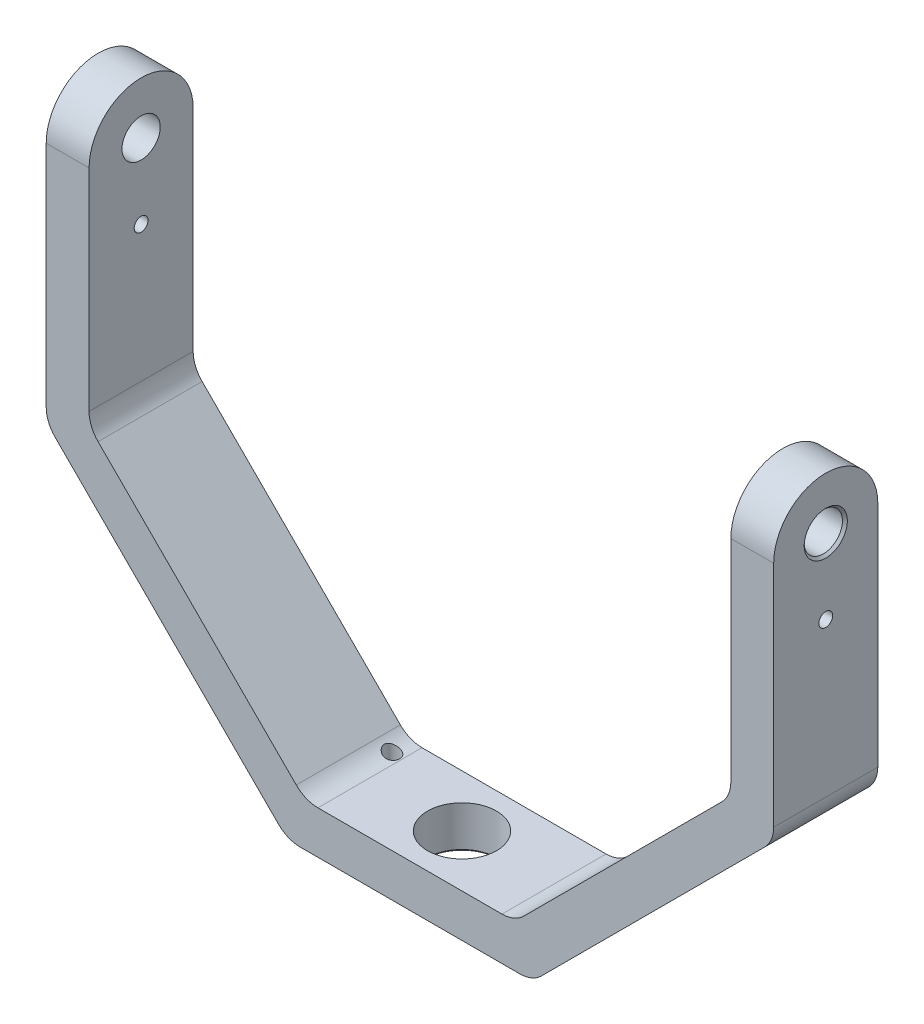
ISO-10303-21;
HEADER;
FILE_DESCRIPTION(('STEP AP214'),'2;1');
FILE_NAME('part.step','',(''),(''),'','','');
FILE_SCHEMA(('AUTOMOTIVE_DESIGN { 1 0 10303 214 1 1 1 1 }'));
ENDSEC;
DATA;
#1=APPLICATION_CONTEXT('core data for automotive mechanical design processes');
#2=APPLICATION_PROTOCOL_DEFINITION('international standard','automotive_design',2000,#1);
#3=PRODUCT_CONTEXT('',#1,'mechanical');
#4=PRODUCT('Part','Part','',(#3));
#5=PRODUCT_RELATED_PRODUCT_CATEGORY('part','',(#4));
#6=PRODUCT_DEFINITION_FORMATION('','',#4);
#7=PRODUCT_DEFINITION_CONTEXT('part definition',#1,'design');
#8=PRODUCT_DEFINITION('design','',#6,#7);
#9=PRODUCT_DEFINITION_SHAPE('','',#8);
#10=(LENGTH_UNIT() NAMED_UNIT(*) SI_UNIT(.MILLI.,.METRE.));
#11=(NAMED_UNIT(*) PLANE_ANGLE_UNIT() SI_UNIT($,.RADIAN.));
#12=(NAMED_UNIT(*) SI_UNIT($,.STERADIAN.) SOLID_ANGLE_UNIT());
#13=UNCERTAINTY_MEASURE_WITH_UNIT(LENGTH_MEASURE(1.E-05),#10,'distance_accuracy_value','');
#14=(GEOMETRIC_REPRESENTATION_CONTEXT(3) GLOBAL_UNCERTAINTY_ASSIGNED_CONTEXT((#13)) GLOBAL_UNIT_ASSIGNED_CONTEXT((#10,
#11,#12)) REPRESENTATION_CONTEXT('',''));
#15=CARTESIAN_POINT('',(0.,0.,0.));
#16=DIRECTION('',(0.,0.,1.));
#17=DIRECTION('',(1.,0.,0.));
#18=AXIS2_PLACEMENT_3D('',#15,#16,#17);
#19=CARTESIAN_POINT('',(-75.4380000000002,46.355,10.795));
#20=DIRECTION('',(-1.,0.,0.));
#21=DIRECTION('',(0.,-1.,0.));
#22=AXIS2_PLACEMENT_3D('',#19,#20,#21);
#23=CYLINDRICAL_SURFACE('',#22,10.795);
#24=DIRECTION('',(1.,0.,0.));
#25=VECTOR('',#24,1.);
#26=CARTESIAN_POINT('',(-75.4380000000002,46.355,0.));
#27=LINE('',#26,#25);
#28=CARTESIAN_POINT('',(-75.4380000000002,46.355,0.));
#29=VERTEX_POINT('',#28);
#30=CARTESIAN_POINT('',(-66.548,46.355,0.));
#31=VERTEX_POINT('',#30);
#32=EDGE_CURVE('E214',#29,#31,#27,.T.);
#33=ORIENTED_EDGE('',*,*,#32,.F.);
#34=CARTESIAN_POINT('',(-75.4380000000002,46.355,10.795));
#35=DIRECTION('',(1.,0.,0.));
#36=DIRECTION('',(0.,1.,0.));
#37=AXIS2_PLACEMENT_3D('',#34,#35,#36);
#38=CIRCLE('',#37,10.795);
#39=CARTESIAN_POINT('',(-75.438,46.355,21.59));
#40=VERTEX_POINT('',#39);
#41=EDGE_CURVE('E220',#40,#29,#38,.F.);
#42=ORIENTED_EDGE('',*,*,#41,.F.);
#43=DIRECTION('',(-1.,0.,0.));
#44=VECTOR('',#43,1.);
#45=CARTESIAN_POINT('',(0.,46.355,21.59));
#46=LINE('',#45,#44);
#47=CARTESIAN_POINT('',(-66.548,46.355,21.59));
#48=VERTEX_POINT('',#47);
#49=EDGE_CURVE('E217',#48,#40,#46,.T.);
#50=ORIENTED_EDGE('',*,*,#49,.F.);
#51=CARTESIAN_POINT('',(-66.548,46.355,10.795));
#52=DIRECTION('',(-1.,0.,0.));
#53=DIRECTION('',(0.,-1.,0.));
#54=AXIS2_PLACEMENT_3D('',#51,#52,#53);
#55=CIRCLE('',#54,10.795);
#56=EDGE_CURVE('E222',#31,#48,#55,.F.);
#57=ORIENTED_EDGE('',*,*,#56,.F.);
#58=EDGE_LOOP('',(#33,#42,#50,#57));
#59=FACE_BOUND('',#58,.T.);
#60=ADVANCED_FACE('F35',(#59),#23,.T.);
#61=CARTESIAN_POINT('',(75.4380000000002,46.355,10.795));
#62=DIRECTION('',(-1.,0.,0.));
#63=DIRECTION('',(0.,-1.,0.));
#64=AXIS2_PLACEMENT_3D('',#61,#62,#63);
#65=CYLINDRICAL_SURFACE('',#64,10.795);
#66=DIRECTION('',(-1.,0.,0.));
#67=VECTOR('',#66,1.);
#68=CARTESIAN_POINT('',(0.,46.355,21.59));
#69=LINE('',#68,#67);
#70=CARTESIAN_POINT('',(75.4380000000002,46.355,21.59));
#71=VERTEX_POINT('',#70);
#72=CARTESIAN_POINT('',(66.548,46.355,21.59));
#73=VERTEX_POINT('',#72);
#74=EDGE_CURVE('E180',#71,#73,#69,.T.);
#75=ORIENTED_EDGE('',*,*,#74,.F.);
#76=CARTESIAN_POINT('',(75.438,46.355,10.795));
#77=DIRECTION('',(-1.,0.,0.));
#78=DIRECTION('',(0.,-1.,0.));
#79=AXIS2_PLACEMENT_3D('',#76,#77,#78);
#80=CIRCLE('',#79,10.795);
#81=CARTESIAN_POINT('',(75.438,46.355,0.));
#82=VERTEX_POINT('',#81);
#83=EDGE_CURVE('E192',#82,#71,#80,.F.);
#84=ORIENTED_EDGE('',*,*,#83,.F.);
#85=DIRECTION('',(1.,0.,0.));
#86=VECTOR('',#85,1.);
#87=CARTESIAN_POINT('',(75.4380000000002,46.355,0.));
#88=LINE('',#87,#86);
#89=CARTESIAN_POINT('',(66.548,46.355,0.));
#90=VERTEX_POINT('',#89);
#91=EDGE_CURVE('E200',#90,#82,#88,.T.);
#92=ORIENTED_EDGE('',*,*,#91,.F.);
#93=CARTESIAN_POINT('',(66.548,46.355,10.795));
#94=DIRECTION('',(1.,0.,0.));
#95=DIRECTION('',(0.,1.,0.));
#96=AXIS2_PLACEMENT_3D('',#93,#94,#95);
#97=CIRCLE('',#96,10.795);
#98=EDGE_CURVE('E199',#73,#90,#97,.F.);
#99=ORIENTED_EDGE('',*,*,#98,.F.);
#100=EDGE_LOOP('',(#75,#84,#92,#99));
#101=FACE_BOUND('',#100,.T.);
#102=ADVANCED_FACE('F202',(#101),#65,.T.);
#103=CARTESIAN_POINT('',(-66.548,0.,21.59));
#104=DIRECTION('',(-0.707106781186551,-0.707106781186544,0.));
#105=DIRECTION('',(0.707106781186544,-0.707106781186551,0.));
#106=AXIS2_PLACEMENT_3D('',#103,#104,#105);
#107=PLANE('',#106);
#108=DIRECTION('',(-0.707106781186544,0.707106781186551,0.));
#109=VECTOR('',#108,1.);
#110=CARTESIAN_POINT('',(-66.548,0.,21.59));
#111=LINE('',#110,#109);
#112=CARTESIAN_POINT('',(-23.5775133699681,-42.9704866300323,21.59));
#113=VERTEX_POINT('',#112);
#114=CARTESIAN_POINT('',(-64.6881280605346,-1.85987193946542,21.59));
#115=VERTEX_POINT('',#114);
#116=EDGE_CURVE('E453',#113,#115,#111,.T.);
#117=ORIENTED_EDGE('',*,*,#116,.F.);
#118=DIRECTION('',(0.,0.,-1.));
#119=VECTOR('',#118,1.);
#120=CARTESIAN_POINT('',(-23.5775133699681,-42.9704866300323,0.));
#121=LINE('',#120,#119);
#122=CARTESIAN_POINT('',(-23.5775133699681,-42.9704866300323,0.));
#123=VERTEX_POINT('',#122);
#124=EDGE_CURVE('E266',#113,#123,#121,.T.);
#125=ORIENTED_EDGE('',*,*,#124,.T.);
#126=DIRECTION('',(-0.707106781186544,0.707106781186551,0.));
#127=VECTOR('',#126,1.);
#128=CARTESIAN_POINT('',(-66.548,0.,0.));
#129=LINE('',#128,#127);
#130=CARTESIAN_POINT('',(-64.6881280605346,-1.85987193946542,0.));
#131=VERTEX_POINT('',#130);
#132=EDGE_CURVE('E429',#123,#131,#129,.T.);
#133=ORIENTED_EDGE('',*,*,#132,.T.);
#134=DIRECTION('',(0.,0.,-1.));
#135=VECTOR('',#134,1.);
#136=CARTESIAN_POINT('',(-64.6881280605346,-1.85987193946542,21.59));
#137=LINE('',#136,#135);
#138=EDGE_CURVE('E264',#131,#115,#137,.F.);
#139=ORIENTED_EDGE('',*,*,#138,.T.);
#140=EDGE_LOOP('',(#117,#125,#133,#139));
#141=FACE_BOUND('',#140,.T.);
#142=ADVANCED_FACE('F377',(#141),#107,.F.);
#143=CARTESIAN_POINT('',(-66.548,0.,21.59));
#144=DIRECTION('',(-1.,0.,0.));
#145=DIRECTION('',(0.,-1.,0.));
#146=AXIS2_PLACEMENT_3D('',#143,#144,#145);
#147=PLANE('',#146);
#148=CARTESIAN_POINT('',(-66.548,30.861,10.795));
#149=DIRECTION('',(-1.,0.,0.));
#150=DIRECTION('',(0.,-1.,0.));
#151=AXIS2_PLACEMENT_3D('',#148,#149,#150);
#152=CIRCLE('',#151,1.4351);
#153=CARTESIAN_POINT('',(-66.548,29.4259,10.795));
#154=VERTEX_POINT('',#153);
#155=EDGE_CURVE('E464',#154,#154,#152,.T.);
#156=ORIENTED_EDGE('',*,*,#155,.T.);
#157=EDGE_LOOP('',(#156));
#158=FACE_BOUND('',#157,.T.);
#159=CARTESIAN_POINT('',(-66.548,46.355,10.795));
#160=DIRECTION('',(-1.,0.,0.));
#161=DIRECTION('',(0.,-1.,0.));
#162=AXIS2_PLACEMENT_3D('',#159,#160,#161);
#163=CIRCLE('',#162,3.96875000000001);
#164=CARTESIAN_POINT('',(-66.548,42.38625,10.795));
#165=VERTEX_POINT('',#164);
#166=EDGE_CURVE('E229',#165,#165,#163,.T.);
#167=ORIENTED_EDGE('',*,*,#166,.T.);
#168=EDGE_LOOP('',(#167));
#169=FACE_BOUND('',#168,.T.);
#170=DIRECTION('',(0.,1.,0.));
#171=VECTOR('',#170,1.);
#172=CARTESIAN_POINT('',(-66.548,0.,21.59));
#173=LINE('',#172,#171);
#174=CARTESIAN_POINT('',(-66.548,2.63025612106914,21.59));
#175=VERTEX_POINT('',#174);
#176=EDGE_CURVE('E421',#175,#48,#173,.T.);
#177=ORIENTED_EDGE('',*,*,#176,.F.);
#178=DIRECTION('',(0.,0.,-1.));
#179=VECTOR('',#178,1.);
#180=CARTESIAN_POINT('',(-66.548,2.63025612106914,0.));
#181=LINE('',#180,#179);
#182=CARTESIAN_POINT('',(-66.548,2.63025612106914,0.));
#183=VERTEX_POINT('',#182);
#184=EDGE_CURVE('E281',#175,#183,#181,.T.);
#185=ORIENTED_EDGE('',*,*,#184,.T.);
#186=DIRECTION('',(0.,1.,0.));
#187=VECTOR('',#186,1.);
#188=CARTESIAN_POINT('',(-66.548,0.,0.));
#189=LINE('',#188,#187);
#190=EDGE_CURVE('E432',#183,#31,#189,.T.);
#191=ORIENTED_EDGE('',*,*,#190,.T.);
#192=ORIENTED_EDGE('',*,*,#56,.T.);
#193=EDGE_LOOP('',(#177,#185,#191,#192));
#194=FACE_BOUND('',#193,.T.);
#195=ADVANCED_FACE('F373',(#158,#169,#194),#147,.F.);
#196=CARTESIAN_POINT('',(-75.438,0.,21.59));
#197=DIRECTION('',(1.,0.,0.));
#198=DIRECTION('',(0.,1.,0.));
#199=AXIS2_PLACEMENT_3D('',#196,#197,#198);
#200=PLANE('',#199);
#201=CARTESIAN_POINT('',(-75.4380000000002,30.861,10.795));
#202=DIRECTION('',(-1.,0.,0.));
#203=DIRECTION('',(0.,-1.,0.));
#204=AXIS2_PLACEMENT_3D('',#201,#202,#203);
#205=CIRCLE('',#204,1.4351);
#206=CARTESIAN_POINT('',(-75.4380000000002,29.4259,10.795));
#207=VERTEX_POINT('',#206);
#208=EDGE_CURVE('E467',#207,#207,#205,.T.);
#209=ORIENTED_EDGE('',*,*,#208,.F.);
#210=EDGE_LOOP('',(#209));
#211=FACE_BOUND('',#210,.T.);
#212=CARTESIAN_POINT('',(-75.4380000000002,46.355,10.795));
#213=DIRECTION('',(1.,0.,0.));
#214=DIRECTION('',(0.,1.,0.));
#215=AXIS2_PLACEMENT_3D('',#212,#213,#214);
#216=CIRCLE('',#215,4.4767499999999);
#217=CARTESIAN_POINT('',(-75.4380000000002,50.8317499999999,10.795));
#218=VERTEX_POINT('',#217);
#219=EDGE_CURVE('E297',#218,#218,#216,.T.);
#220=ORIENTED_EDGE('',*,*,#219,.T.);
#221=EDGE_LOOP('',(#220));
#222=FACE_BOUND('',#221,.T.);
#223=DIRECTION('',(0.,-1.,0.));
#224=VECTOR('',#223,1.);
#225=CARTESIAN_POINT('',(-75.438,0.,0.));
#226=LINE('',#225,#224);
#227=CARTESIAN_POINT('',(-75.438,-1.05210244842764,0.));
#228=VERTEX_POINT('',#227);
#229=EDGE_CURVE('E434',#29,#228,#226,.T.);
#230=ORIENTED_EDGE('',*,*,#229,.T.);
#231=DIRECTION('',(0.,0.,-1.));
#232=VECTOR('',#231,1.);
#233=CARTESIAN_POINT('',(-75.438,-1.05210244842764,21.59));
#234=LINE('',#233,#232);
#235=CARTESIAN_POINT('',(-75.438,-1.05210244842763,21.59));
#236=VERTEX_POINT('',#235);
#237=EDGE_CURVE('E262',#228,#236,#234,.F.);
#238=ORIENTED_EDGE('',*,*,#237,.T.);
#239=DIRECTION('',(0.,-1.,0.));
#240=VECTOR('',#239,1.);
#241=CARTESIAN_POINT('',(-75.438,57.15,21.59));
#242=LINE('',#241,#240);
#243=EDGE_CURVE('E414',#40,#236,#242,.T.);
#244=ORIENTED_EDGE('',*,*,#243,.F.);
#245=ORIENTED_EDGE('',*,*,#41,.T.);
#246=EDGE_LOOP('',(#230,#238,#244,#245));
#247=FACE_BOUND('',#246,.T.);
#248=ADVANCED_FACE('F369',(#211,#222,#247),#200,.F.);
#249=CARTESIAN_POINT('',(-25.3999999999992,-53.7203585694981,21.59));
#250=DIRECTION('',(0.707106781186551,0.707106781186544,0.));
#251=DIRECTION('',(-0.707106781186544,0.707106781186551,0.));
#252=AXIS2_PLACEMENT_3D('',#249,#250,#251);
#253=PLANE('',#252);
#254=DIRECTION('',(0.707106781186544,-0.707106781186551,0.));
#255=VECTOR('',#254,1.);
#256=CARTESIAN_POINT('',(-25.3999999999992,-53.7203585694981,0.));
#257=LINE('',#256,#255);
#258=CARTESIAN_POINT('',(-73.5781280605347,-5.54223050896217,0.));
#259=VERTEX_POINT('',#258);
#260=CARTESIAN_POINT('',(-27.2598719394647,-51.8604866300326,0.));
#261=VERTEX_POINT('',#260);
#262=EDGE_CURVE('E437',#259,#261,#257,.T.);
#263=ORIENTED_EDGE('',*,*,#262,.T.);
#264=DIRECTION('',(0.,0.,-1.));
#265=VECTOR('',#264,1.);
#266=CARTESIAN_POINT('',(-27.2598719394647,-51.8604866300326,21.59));
#267=LINE('',#266,#265);
#268=CARTESIAN_POINT('',(-27.2598719394647,-51.8604866300326,21.59));
#269=VERTEX_POINT('',#268);
#270=EDGE_CURVE('E258',#261,#269,#267,.F.);
#271=ORIENTED_EDGE('',*,*,#270,.T.);
#272=DIRECTION('',(0.707106781186544,-0.707106781186551,0.));
#273=VECTOR('',#272,1.);
#274=CARTESIAN_POINT('',(-25.3999999999992,-53.7203585694981,21.59));
#275=LINE('',#274,#273);
#276=CARTESIAN_POINT('',(-73.5781280605347,-5.54223050896217,21.59));
#277=VERTEX_POINT('',#276);
#278=EDGE_CURVE('E411',#277,#269,#275,.T.);
#279=ORIENTED_EDGE('',*,*,#278,.F.);
#280=DIRECTION('',(0.,0.,-1.));
#281=VECTOR('',#280,1.);
#282=CARTESIAN_POINT('',(-73.5781280605347,-5.54223050896217,21.59));
#283=LINE('',#282,#281);
#284=EDGE_CURVE('E255',#277,#259,#283,.T.);
#285=ORIENTED_EDGE('',*,*,#284,.T.);
#286=EDGE_LOOP('',(#263,#271,#279,#285));
#287=FACE_BOUND('',#286,.T.);
#288=ADVANCED_FACE('F365',(#287),#253,.F.);
#289=CARTESIAN_POINT('',(-25.3999999999992,-53.7203585694981,21.59));
#290=DIRECTION('',(0.,1.,0.));
#291=DIRECTION('',(-1.,0.,0.));
#292=AXIS2_PLACEMENT_3D('',#289,#290,#291);
#293=PLANE('',#292);
#294=CARTESIAN_POINT('',(8.74208275905901E-13,-53.7203585694977,10.795));
#295=DIRECTION('',(0.,1.,0.));
#296=DIRECTION('',(-1.,0.,0.));
#297=AXIS2_PLACEMENT_3D('',#294,#295,#296);
#298=CIRCLE('',#297,7.65174999999994);
#299=CARTESIAN_POINT('',(-7.65174999999907,-53.7203585694978,10.795));
#300=VERTEX_POINT('',#299);
#301=EDGE_CURVE('E11',#300,#300,#298,.T.);
#302=ORIENTED_EDGE('',*,*,#301,.T.);
#303=EDGE_LOOP('',(#302));
#304=FACE_BOUND('',#303,.T.);
#305=CARTESIAN_POINT('',(-20.99174387893,-53.7203585694978,4.318));
#306=DIRECTION('',(0.,-1.,0.));
#307=DIRECTION('',(1.,0.,0.));
#308=AXIS2_PLACEMENT_3D('',#305,#306,#307);
#309=CIRCLE('',#308,1.5875000000018);
#310=CARTESIAN_POINT('',(-19.4042438789282,-53.7203585694978,4.318));
#311=VERTEX_POINT('',#310);
#312=EDGE_CURVE('E315',#311,#311,#309,.T.);
#313=ORIENTED_EDGE('',*,*,#312,.F.);
#314=EDGE_LOOP('',(#313));
#315=FACE_BOUND('',#314,.T.);
#316=DIRECTION('',(1.,0.,0.));
#317=VECTOR('',#316,1.);
#318=CARTESIAN_POINT('',(-25.3999999999992,-53.7203585694981,0.));
#319=LINE('',#318,#317);
#320=CARTESIAN_POINT('',(-22.76974387893,-53.720358569498,0.));
#321=VERTEX_POINT('',#320);
#322=CARTESIAN_POINT('',(22.7697438789309,-53.7203585694973,0.));
#323=VERTEX_POINT('',#322);
#324=EDGE_CURVE('E439',#321,#323,#319,.T.);
#325=ORIENTED_EDGE('',*,*,#324,.T.);
#326=DIRECTION('',(0.,0.,-1.));
#327=VECTOR('',#326,1.);
#328=CARTESIAN_POINT('',(22.7697438789309,-53.7203585694973,21.59));
#329=LINE('',#328,#327);
#330=CARTESIAN_POINT('',(22.7697438789309,-53.7203585694973,21.59));
#331=VERTEX_POINT('',#330);
#332=EDGE_CURVE('E246',#323,#331,#329,.F.);
#333=ORIENTED_EDGE('',*,*,#332,.T.);
#334=DIRECTION('',(1.,0.,0.));
#335=VECTOR('',#334,1.);
#336=CARTESIAN_POINT('',(-25.3999999999992,-53.7203585694981,21.59));
#337=LINE('',#336,#335);
#338=CARTESIAN_POINT('',(-22.76974387893,-53.720358569498,21.59));
#339=VERTEX_POINT('',#338);
#340=EDGE_CURVE('E418',#339,#331,#337,.T.);
#341=ORIENTED_EDGE('',*,*,#340,.F.);
#342=DIRECTION('',(0.,0.,-1.));
#343=VECTOR('',#342,1.);
#344=CARTESIAN_POINT('',(-22.76974387893,-53.720358569498,21.59));
#345=LINE('',#344,#343);
#346=EDGE_CURVE('E243',#339,#321,#345,.T.);
#347=ORIENTED_EDGE('',*,*,#346,.T.);
#348=EDGE_LOOP('',(#325,#333,#341,#347));
#349=FACE_BOUND('',#348,.T.);
#350=ADVANCED_FACE('F361',(#304,#315,#349),#293,.F.);
#351=CARTESIAN_POINT('',(25.4,-53.7203585694972,21.59));
#352=DIRECTION('',(-0.707106781186551,0.707106781186544,0.));
#353=DIRECTION('',(-0.707106781186544,-0.707106781186551,0.));
#354=AXIS2_PLACEMENT_3D('',#351,#352,#353);
#355=PLANE('',#354);
#356=DIRECTION('',(0.707106781186544,0.707106781186551,0.));
#357=VECTOR('',#356,1.);
#358=CARTESIAN_POINT('',(25.4,-53.7203585694972,21.59));
#359=LINE('',#358,#357);
#360=CARTESIAN_POINT('',(27.2598719394654,-51.8604866300318,21.59));
#361=VERTEX_POINT('',#360);
#362=CARTESIAN_POINT('',(73.5781280605347,-5.54223050896216,21.59));
#363=VERTEX_POINT('',#362);
#364=EDGE_CURVE('E189',#361,#363,#359,.T.);
#365=ORIENTED_EDGE('',*,*,#364,.F.);
#366=DIRECTION('',(0.,0.,-1.));
#367=VECTOR('',#366,1.);
#368=CARTESIAN_POINT('',(27.2598719394654,-51.8604866300318,21.59));
#369=LINE('',#368,#367);
#370=CARTESIAN_POINT('',(27.2598719394654,-51.8604866300318,0.));
#371=VERTEX_POINT('',#370);
#372=EDGE_CURVE('E232',#361,#371,#369,.T.);
#373=ORIENTED_EDGE('',*,*,#372,.T.);
#374=DIRECTION('',(0.707106781186544,0.707106781186551,0.));
#375=VECTOR('',#374,1.);
#376=CARTESIAN_POINT('',(25.4,-53.7203585694972,0.));
#377=LINE('',#376,#375);
#378=CARTESIAN_POINT('',(73.5781280605347,-5.54223050896216,0.));
#379=VERTEX_POINT('',#378);
#380=EDGE_CURVE('E442',#371,#379,#377,.T.);
#381=ORIENTED_EDGE('',*,*,#380,.T.);
#382=DIRECTION('',(0.,0.,-1.));
#383=VECTOR('',#382,1.);
#384=CARTESIAN_POINT('',(73.5781280605347,-5.54223050896216,21.59));
#385=LINE('',#384,#383);
#386=EDGE_CURVE('E225',#379,#363,#385,.F.);
#387=ORIENTED_EDGE('',*,*,#386,.T.);
#388=EDGE_LOOP('',(#365,#373,#381,#387));
#389=FACE_BOUND('',#388,.T.);
#390=ADVANCED_FACE('F357',(#389),#355,.F.);
#391=CARTESIAN_POINT('',(75.438,57.15,21.59));
#392=DIRECTION('',(-1.,0.,0.));
#393=DIRECTION('',(0.,-1.,0.));
#394=AXIS2_PLACEMENT_3D('',#391,#392,#393);
#395=PLANE('',#394);
#396=CARTESIAN_POINT('',(75.4380000000004,30.8610000000005,10.795));
#397=DIRECTION('',(-1.,0.,0.));
#398=DIRECTION('',(0.,-1.,0.));
#399=AXIS2_PLACEMENT_3D('',#396,#397,#398);
#400=CIRCLE('',#399,1.4351);
#401=CARTESIAN_POINT('',(75.4380000000004,29.4259000000005,10.795));
#402=VERTEX_POINT('',#401);
#403=EDGE_CURVE('E470',#402,#402,#400,.T.);
#404=ORIENTED_EDGE('',*,*,#403,.T.);
#405=EDGE_LOOP('',(#404));
#406=FACE_BOUND('',#405,.T.);
#407=CARTESIAN_POINT('',(75.438,46.355,10.795));
#408=DIRECTION('',(-1.,0.,0.));
#409=DIRECTION('',(0.,-1.,0.));
#410=AXIS2_PLACEMENT_3D('',#407,#408,#409);
#411=CIRCLE('',#410,4.47675000000002);
#412=CARTESIAN_POINT('',(75.438,41.87825,10.795));
#413=VERTEX_POINT('',#412);
#414=EDGE_CURVE('E306',#413,#413,#411,.T.);
#415=ORIENTED_EDGE('',*,*,#414,.T.);
#416=EDGE_LOOP('',(#415));
#417=FACE_BOUND('',#416,.T.);
#418=DIRECTION('',(0.,1.,0.));
#419=VECTOR('',#418,1.);
#420=CARTESIAN_POINT('',(75.438,0.,21.59));
#421=LINE('',#420,#419);
#422=CARTESIAN_POINT('',(75.438,-1.05210244842761,21.59));
#423=VERTEX_POINT('',#422);
#424=EDGE_CURVE('E174',#423,#71,#421,.T.);
#425=ORIENTED_EDGE('',*,*,#424,.F.);
#426=DIRECTION('',(0.,0.,-1.));
#427=VECTOR('',#426,1.);
#428=CARTESIAN_POINT('',(75.438,-1.05210244842761,21.59));
#429=LINE('',#428,#427);
#430=CARTESIAN_POINT('',(75.438,-1.0521024484276,0.));
#431=VERTEX_POINT('',#430);
#432=EDGE_CURVE('E260',#423,#431,#429,.T.);
#433=ORIENTED_EDGE('',*,*,#432,.T.);
#434=DIRECTION('',(0.,1.,0.));
#435=VECTOR('',#434,1.);
#436=CARTESIAN_POINT('',(75.438,57.15,0.));
#437=LINE('',#436,#435);
#438=EDGE_CURVE('E195',#431,#82,#437,.T.);
#439=ORIENTED_EDGE('',*,*,#438,.T.);
#440=ORIENTED_EDGE('',*,*,#83,.T.);
#441=EDGE_LOOP('',(#425,#433,#439,#440));
#442=FACE_BOUND('',#441,.T.);
#443=ADVANCED_FACE('F193',(#406,#417,#442),#395,.F.);
#444=CARTESIAN_POINT('',(66.548,0.,21.59));
#445=DIRECTION('',(1.,0.,0.));
#446=DIRECTION('',(0.,1.,0.));
#447=AXIS2_PLACEMENT_3D('',#444,#445,#446);
#448=PLANE('',#447);
#449=CARTESIAN_POINT('',(66.548,30.8610000000005,10.795));
#450=DIRECTION('',(1.,0.,0.));
#451=DIRECTION('',(0.,1.,0.));
#452=AXIS2_PLACEMENT_3D('',#449,#450,#451);
#453=CIRCLE('',#452,1.4351);
#454=CARTESIAN_POINT('',(66.548,32.2961000000005,10.795));
#455=VERTEX_POINT('',#454);
#456=EDGE_CURVE('E39',#455,#455,#453,.T.);
#457=ORIENTED_EDGE('',*,*,#456,.T.);
#458=EDGE_LOOP('',(#457));
#459=FACE_BOUND('',#458,.T.);
#460=CARTESIAN_POINT('',(66.548,46.355,10.795));
#461=DIRECTION('',(1.,0.,0.));
#462=DIRECTION('',(0.,1.,0.));
#463=AXIS2_PLACEMENT_3D('',#460,#461,#462);
#464=CIRCLE('',#463,3.96875000000001);
#465=CARTESIAN_POINT('',(66.548,50.32375,10.795));
#466=VERTEX_POINT('',#465);
#467=EDGE_CURVE('E226',#466,#466,#464,.T.);
#468=ORIENTED_EDGE('',*,*,#467,.T.);
#469=EDGE_LOOP('',(#468));
#470=FACE_BOUND('',#469,.T.);
#471=DIRECTION('',(0.,-1.,0.));
#472=VECTOR('',#471,1.);
#473=CARTESIAN_POINT('',(66.548,0.,0.));
#474=LINE('',#473,#472);
#475=CARTESIAN_POINT('',(66.548,2.63025612106914,0.));
#476=VERTEX_POINT('',#475);
#477=EDGE_CURVE('E446',#90,#476,#474,.T.);
#478=ORIENTED_EDGE('',*,*,#477,.T.);
#479=DIRECTION('',(0.,0.,-1.));
#480=VECTOR('',#479,1.);
#481=CARTESIAN_POINT('',(66.548,2.63025612106914,21.59));
#482=LINE('',#481,#480);
#483=CARTESIAN_POINT('',(66.548,2.63025612106914,21.59));
#484=VERTEX_POINT('',#483);
#485=EDGE_CURVE('E279',#476,#484,#482,.F.);
#486=ORIENTED_EDGE('',*,*,#485,.T.);
#487=DIRECTION('',(0.,-1.,0.));
#488=VECTOR('',#487,1.);
#489=CARTESIAN_POINT('',(66.548,0.,21.59));
#490=LINE('',#489,#488);
#491=EDGE_CURVE('E188',#73,#484,#490,.T.);
#492=ORIENTED_EDGE('',*,*,#491,.F.);
#493=ORIENTED_EDGE('',*,*,#98,.T.);
#494=EDGE_LOOP('',(#478,#486,#492,#493));
#495=FACE_BOUND('',#494,.T.);
#496=ADVANCED_FACE('F350',(#459,#470,#495),#448,.F.);
#497=CARTESIAN_POINT('',(66.548,0.,21.59));
#498=DIRECTION('',(0.707106781186551,-0.707106781186544,0.));
#499=DIRECTION('',(0.707106781186544,0.707106781186551,0.));
#500=AXIS2_PLACEMENT_3D('',#497,#498,#499);
#501=PLANE('',#500);
#502=DIRECTION('',(-0.707106781186544,-0.707106781186551,0.));
#503=VECTOR('',#502,1.);
#504=CARTESIAN_POINT('',(66.548,0.,0.));
#505=LINE('',#504,#503);
#506=CARTESIAN_POINT('',(64.6881280605346,-1.85987193946542,0.));
#507=VERTEX_POINT('',#506);
#508=CARTESIAN_POINT('',(23.5775133699683,-42.9704866300321,0.));
#509=VERTEX_POINT('',#508);
#510=EDGE_CURVE('E448',#507,#509,#505,.T.);
#511=ORIENTED_EDGE('',*,*,#510,.T.);
#512=DIRECTION('',(0.,0.,-1.));
#513=VECTOR('',#512,1.);
#514=CARTESIAN_POINT('',(23.5775133699683,-42.9704866300321,21.59));
#515=LINE('',#514,#513);
#516=CARTESIAN_POINT('',(23.5775133699683,-42.9704866300321,21.59));
#517=VERTEX_POINT('',#516);
#518=EDGE_CURVE('E277',#509,#517,#515,.F.);
#519=ORIENTED_EDGE('',*,*,#518,.T.);
#520=DIRECTION('',(-0.707106781186544,-0.707106781186551,0.));
#521=VECTOR('',#520,1.);
#522=CARTESIAN_POINT('',(66.548,0.,21.59));
#523=LINE('',#522,#521);
#524=CARTESIAN_POINT('',(64.6881280605346,-1.85987193946542,21.59));
#525=VERTEX_POINT('',#524);
#526=EDGE_CURVE('E207',#525,#517,#523,.T.);
#527=ORIENTED_EDGE('',*,*,#526,.F.);
#528=DIRECTION('',(0.,0.,-1.));
#529=VECTOR('',#528,1.);
#530=CARTESIAN_POINT('',(64.6881280605346,-1.85987193946542,0.));
#531=LINE('',#530,#529);
#532=EDGE_CURVE('E274',#525,#507,#531,.T.);
#533=ORIENTED_EDGE('',*,*,#532,.T.);
#534=EDGE_LOOP('',(#511,#519,#527,#533));
#535=FACE_BOUND('',#534,.T.);
#536=ADVANCED_FACE('F346',(#535),#501,.F.);
#537=CARTESIAN_POINT('',(-21.7176414305027,-44.8303585694978,21.59));
#538=DIRECTION('',(0.,-1.,0.));
#539=DIRECTION('',(1.,0.,0.));
#540=AXIS2_PLACEMENT_3D('',#537,#538,#539);
#541=PLANE('',#540);
#542=CARTESIAN_POINT('',(8.07421422080794E-13,-44.8303585694977,10.795));
#543=DIRECTION('',(0.,-1.,0.));
#544=DIRECTION('',(1.,0.,0.));
#545=AXIS2_PLACEMENT_3D('',#542,#543,#544);
#546=CIRCLE('',#545,7.14375);
#547=CARTESIAN_POINT('',(7.14375000000081,-44.8303585694977,10.795));
#548=VERTEX_POINT('',#547);
#549=EDGE_CURVE('E316',#548,#548,#546,.T.);
#550=ORIENTED_EDGE('',*,*,#549,.T.);
#551=EDGE_LOOP('',(#550));
#552=FACE_BOUND('',#551,.T.);
#553=DIRECTION('',(-1.,0.,0.));
#554=VECTOR('',#553,1.);
#555=CARTESIAN_POINT('',(-21.7176414305027,-44.8303585694978,0.));
#556=LINE('',#555,#554);
#557=CARTESIAN_POINT('',(19.0873853094337,-44.8303585694976,0.));
#558=VERTEX_POINT('',#557);
#559=CARTESIAN_POINT('',(-19.0873853094335,-44.8303585694978,0.));
#560=VERTEX_POINT('',#559);
#561=EDGE_CURVE('E210',#558,#560,#556,.T.);
#562=ORIENTED_EDGE('',*,*,#561,.T.);
#563=DIRECTION('',(0.,0.,-1.));
#564=VECTOR('',#563,1.);
#565=CARTESIAN_POINT('',(-19.0873853094335,-44.8303585694978,21.59));
#566=LINE('',#565,#564);
#567=CARTESIAN_POINT('',(-19.0873853094335,-44.8303585694978,21.59));
#568=VERTEX_POINT('',#567);
#569=EDGE_CURVE('E272',#560,#568,#566,.F.);
#570=ORIENTED_EDGE('',*,*,#569,.T.);
#571=DIRECTION('',(-1.,0.,0.));
#572=VECTOR('',#571,1.);
#573=CARTESIAN_POINT('',(-21.7176414305027,-44.8303585694978,21.59));
#574=LINE('',#573,#572);
#575=CARTESIAN_POINT('',(19.0873853094337,-44.8303585694976,21.59));
#576=VERTEX_POINT('',#575);
#577=EDGE_CURVE('E203',#576,#568,#574,.T.);
#578=ORIENTED_EDGE('',*,*,#577,.F.);
#579=DIRECTION('',(0.,0.,-1.));
#580=VECTOR('',#579,1.);
#581=CARTESIAN_POINT('',(19.0873853094337,-44.8303585694976,0.));
#582=LINE('',#581,#580);
#583=EDGE_CURVE('E269',#576,#558,#582,.T.);
#584=ORIENTED_EDGE('',*,*,#583,.T.);
#585=EDGE_LOOP('',(#562,#570,#578,#584));
#586=FACE_BOUND('',#585,.T.);
#587=ADVANCED_FACE('F340',(#552,#586),#541,.F.);
#588=CARTESIAN_POINT('',(0.,0.,21.59));
#589=DIRECTION('',(0.,0.,-1.));
#590=DIRECTION('',(-1.,0.,0.));
#591=AXIS2_PLACEMENT_3D('',#588,#589,#590);
#592=PLANE('',#591);
#593=ORIENTED_EDGE('',*,*,#340,.T.);
#594=CARTESIAN_POINT('',(22.7697438789308,-47.3703585694973,21.59));
#595=DIRECTION('',(0.,0.,-1.));
#596=DIRECTION('',(-1.,0.,0.));
#597=AXIS2_PLACEMENT_3D('',#594,#595,#596);
#598=CIRCLE('',#597,6.35);
#599=EDGE_CURVE('E253',#331,#361,#598,.F.);
#600=ORIENTED_EDGE('',*,*,#599,.T.);
#601=ORIENTED_EDGE('',*,*,#364,.T.);
#602=CARTESIAN_POINT('',(69.0880000000001,-1.05210244842761,21.59));
#603=DIRECTION('',(0.,0.,-1.));
#604=DIRECTION('',(-1.,0.,0.));
#605=AXIS2_PLACEMENT_3D('',#602,#603,#604);
#606=CIRCLE('',#605,6.35);
#607=EDGE_CURVE('E184',#363,#423,#606,.F.);
#608=ORIENTED_EDGE('',*,*,#607,.T.);
#609=ORIENTED_EDGE('',*,*,#424,.T.);
#610=ORIENTED_EDGE('',*,*,#74,.T.);
#611=ORIENTED_EDGE('',*,*,#491,.T.);
#612=CARTESIAN_POINT('',(60.198,2.63025612106914,21.59));
#613=DIRECTION('',(0.,0.,-1.));
#614=DIRECTION('',(-1.,0.,0.));
#615=AXIS2_PLACEMENT_3D('',#612,#613,#614);
#616=CIRCLE('',#615,6.35);
#617=EDGE_CURVE('E293',#484,#525,#616,.T.);
#618=ORIENTED_EDGE('',*,*,#617,.T.);
#619=ORIENTED_EDGE('',*,*,#526,.T.);
#620=CARTESIAN_POINT('',(19.0873853094337,-38.4803585694976,21.59));
#621=DIRECTION('',(0.,0.,-1.));
#622=DIRECTION('',(-1.,0.,0.));
#623=AXIS2_PLACEMENT_3D('',#620,#621,#622);
#624=CIRCLE('',#623,6.35);
#625=EDGE_CURVE('E289',#517,#576,#624,.T.);
#626=ORIENTED_EDGE('',*,*,#625,.T.);
#627=ORIENTED_EDGE('',*,*,#577,.T.);
#628=CARTESIAN_POINT('',(-19.0873853094335,-38.4803585694978,21.59));
#629=DIRECTION('',(0.,0.,-1.));
#630=DIRECTION('',(-1.,0.,0.));
#631=AXIS2_PLACEMENT_3D('',#628,#629,#630);
#632=CIRCLE('',#631,6.35);
#633=EDGE_CURVE('E285',#568,#113,#632,.T.);
#634=ORIENTED_EDGE('',*,*,#633,.T.);
#635=ORIENTED_EDGE('',*,*,#116,.T.);
#636=CARTESIAN_POINT('',(-60.198,2.63025612106914,21.59));
#637=DIRECTION('',(0.,0.,-1.));
#638=DIRECTION('',(-1.,0.,0.));
#639=AXIS2_PLACEMENT_3D('',#636,#637,#638);
#640=CIRCLE('',#639,6.35);
#641=EDGE_CURVE('E51',#115,#175,#640,.T.);
#642=ORIENTED_EDGE('',*,*,#641,.T.);
#643=ORIENTED_EDGE('',*,*,#176,.T.);
#644=ORIENTED_EDGE('',*,*,#49,.T.);
#645=ORIENTED_EDGE('',*,*,#243,.T.);
#646=CARTESIAN_POINT('',(-69.0880000000001,-1.05210244842762,21.59));
#647=DIRECTION('',(0.,0.,-1.));
#648=DIRECTION('',(-1.,0.,0.));
#649=AXIS2_PLACEMENT_3D('',#646,#647,#648);
#650=CIRCLE('',#649,6.35);
#651=EDGE_CURVE('E248',#236,#277,#650,.F.);
#652=ORIENTED_EDGE('',*,*,#651,.T.);
#653=ORIENTED_EDGE('',*,*,#278,.T.);
#654=CARTESIAN_POINT('',(-22.7697438789301,-47.370358569498,21.59));
#655=DIRECTION('',(0.,0.,-1.));
#656=DIRECTION('',(-1.,0.,0.));
#657=AXIS2_PLACEMENT_3D('',#654,#655,#656);
#658=CIRCLE('',#657,6.35);
#659=EDGE_CURVE('E251',#269,#339,#658,.F.);
#660=ORIENTED_EDGE('',*,*,#659,.T.);
#661=EDGE_LOOP('',(#593,#600,#601,#608,#609,#610,#611,#618,#619,#626,#627,#634,#635,#642,#643,
#644,#645,#652,#653,#660));
#662=FACE_BOUND('',#661,.T.);
#663=ADVANCED_FACE('F177',(#662),#592,.F.);
#664=CARTESIAN_POINT('',(0.,0.,0.));
#665=DIRECTION('',(0.,0.,-1.));
#666=DIRECTION('',(-1.,0.,0.));
#667=AXIS2_PLACEMENT_3D('',#664,#665,#666);
#668=PLANE('',#667);
#669=ORIENTED_EDGE('',*,*,#380,.F.);
#670=CARTESIAN_POINT('',(22.7697438789308,-47.3703585694973,0.));
#671=DIRECTION('',(0.,0.,-1.));
#672=DIRECTION('',(-1.,0.,0.));
#673=AXIS2_PLACEMENT_3D('',#670,#671,#672);
#674=CIRCLE('',#673,6.35);
#675=EDGE_CURVE('E241',#371,#323,#674,.T.);
#676=ORIENTED_EDGE('',*,*,#675,.T.);
#677=ORIENTED_EDGE('',*,*,#324,.F.);
#678=CARTESIAN_POINT('',(-22.7697438789301,-47.370358569498,0.));
#679=DIRECTION('',(0.,0.,-1.));
#680=DIRECTION('',(-1.,0.,0.));
#681=AXIS2_PLACEMENT_3D('',#678,#679,#680);
#682=CIRCLE('',#681,6.35);
#683=EDGE_CURVE('E239',#321,#261,#682,.T.);
#684=ORIENTED_EDGE('',*,*,#683,.T.);
#685=ORIENTED_EDGE('',*,*,#262,.F.);
#686=CARTESIAN_POINT('',(-69.0880000000001,-1.05210244842762,0.));
#687=DIRECTION('',(0.,0.,-1.));
#688=DIRECTION('',(-1.,0.,0.));
#689=AXIS2_PLACEMENT_3D('',#686,#687,#688);
#690=CIRCLE('',#689,6.35);
#691=EDGE_CURVE('E235',#259,#228,#690,.T.);
#692=ORIENTED_EDGE('',*,*,#691,.T.);
#693=ORIENTED_EDGE('',*,*,#229,.F.);
#694=ORIENTED_EDGE('',*,*,#32,.T.);
#695=ORIENTED_EDGE('',*,*,#190,.F.);
#696=CARTESIAN_POINT('',(-60.198,2.63025612106914,0.));
#697=DIRECTION('',(0.,0.,-1.));
#698=DIRECTION('',(-1.,0.,0.));
#699=AXIS2_PLACEMENT_3D('',#696,#697,#698);
#700=CIRCLE('',#699,6.35);
#701=EDGE_CURVE('E59',#183,#131,#700,.F.);
#702=ORIENTED_EDGE('',*,*,#701,.T.);
#703=ORIENTED_EDGE('',*,*,#132,.F.);
#704=CARTESIAN_POINT('',(-19.0873853094335,-38.4803585694978,0.));
#705=DIRECTION('',(0.,0.,-1.));
#706=DIRECTION('',(-1.,0.,0.));
#707=AXIS2_PLACEMENT_3D('',#704,#705,#706);
#708=CIRCLE('',#707,6.35);
#709=EDGE_CURVE('E283',#123,#560,#708,.F.);
#710=ORIENTED_EDGE('',*,*,#709,.T.);
#711=ORIENTED_EDGE('',*,*,#561,.F.);
#712=CARTESIAN_POINT('',(19.0873853094337,-38.4803585694976,0.));
#713=DIRECTION('',(0.,0.,-1.));
#714=DIRECTION('',(-1.,0.,0.));
#715=AXIS2_PLACEMENT_3D('',#712,#713,#714);
#716=CIRCLE('',#715,6.35);
#717=EDGE_CURVE('E287',#558,#509,#716,.F.);
#718=ORIENTED_EDGE('',*,*,#717,.T.);
#719=ORIENTED_EDGE('',*,*,#510,.F.);
#720=CARTESIAN_POINT('',(60.198,2.63025612106914,0.));
#721=DIRECTION('',(0.,0.,-1.));
#722=DIRECTION('',(-1.,0.,0.));
#723=AXIS2_PLACEMENT_3D('',#720,#721,#722);
#724=CIRCLE('',#723,6.35);
#725=EDGE_CURVE('E291',#507,#476,#724,.F.);
#726=ORIENTED_EDGE('',*,*,#725,.T.);
#727=ORIENTED_EDGE('',*,*,#477,.F.);
#728=ORIENTED_EDGE('',*,*,#91,.T.);
#729=ORIENTED_EDGE('',*,*,#438,.F.);
#730=CARTESIAN_POINT('',(69.0880000000001,-1.05210244842761,0.));
#731=DIRECTION('',(0.,0.,-1.));
#732=DIRECTION('',(-1.,0.,0.));
#733=AXIS2_PLACEMENT_3D('',#730,#731,#732);
#734=CIRCLE('',#733,6.35);
#735=EDGE_CURVE('E237',#431,#379,#734,.T.);
#736=ORIENTED_EDGE('',*,*,#735,.T.);
#737=EDGE_LOOP('',(#669,#676,#677,#684,#685,#692,#693,#694,#695,#702,#703,#710,#711,#718,#719,
#726,#727,#728,#729,#736));
#738=FACE_BOUND('',#737,.T.);
#739=ADVANCED_FACE('F339',(#738),#668,.T.);
#740=CARTESIAN_POINT('',(-75.4380000000002,46.355,10.795));
#741=DIRECTION('',(1.,0.,0.));
#742=DIRECTION('',(0.,1.,0.));
#743=AXIS2_PLACEMENT_3D('',#740,#741,#742);
#744=CYLINDRICAL_SURFACE('',#743,3.96875000000001);
#745=CARTESIAN_POINT('',(74.93,46.355,10.795));
#746=DIRECTION('',(-1.,0.,0.));
#747=DIRECTION('',(0.,0.,1.));
#748=AXIS2_PLACEMENT_3D('',#745,#746,#747);
#749=CIRCLE('',#748,3.96875000000001);
#750=CARTESIAN_POINT('',(74.93,46.355,14.76375));
#751=VERTEX_POINT('',#750);
#752=EDGE_CURVE('E303',#751,#751,#749,.F.);
#753=ORIENTED_EDGE('',*,*,#752,.T.);
#754=EDGE_LOOP('',(#753));
#755=FACE_BOUND('',#754,.T.);
#756=ORIENTED_EDGE('',*,*,#467,.F.);
#757=EDGE_LOOP('',(#756));
#758=FACE_BOUND('',#757,.T.);
#759=ADVANCED_FACE('F335',(#755,#758),#744,.F.);
#760=CARTESIAN_POINT('',(-74.9300000000003,46.355,10.795));
#761=DIRECTION('',(1.,0.,0.));
#762=DIRECTION('',(0.,0.,-1.));
#763=AXIS2_PLACEMENT_3D('',#760,#761,#762);
#764=CIRCLE('',#763,3.96875000000001);
#765=CARTESIAN_POINT('',(-74.9300000000003,46.355,6.82624999999999));
#766=VERTEX_POINT('',#765);
#767=EDGE_CURVE('E300',#766,#766,#764,.F.);
#768=ORIENTED_EDGE('',*,*,#767,.T.);
#769=EDGE_LOOP('',(#768));
#770=FACE_BOUND('',#769,.T.);
#771=ORIENTED_EDGE('',*,*,#166,.F.);
#772=EDGE_LOOP('',(#771));
#773=FACE_BOUND('',#772,.T.);
#774=ADVANCED_FACE('F331',(#770,#773),#744,.F.);
#775=CARTESIAN_POINT('',(22.7697438789308,-47.3703585694973,21.59));
#776=DIRECTION('',(0.,0.,-1.));
#777=DIRECTION('',(-1.,0.,0.));
#778=AXIS2_PLACEMENT_3D('',#775,#776,#777);
#779=CYLINDRICAL_SURFACE('',#778,6.35);
#780=ORIENTED_EDGE('',*,*,#599,.F.);
#781=ORIENTED_EDGE('',*,*,#332,.F.);
#782=ORIENTED_EDGE('',*,*,#675,.F.);
#783=ORIENTED_EDGE('',*,*,#372,.F.);
#784=EDGE_LOOP('',(#780,#781,#782,#783));
#785=FACE_BOUND('',#784,.T.);
#786=ADVANCED_FACE('F334',(#785),#779,.T.);
#787=CARTESIAN_POINT('',(-22.7697438789301,-47.370358569498,21.59));
#788=DIRECTION('',(0.,0.,-1.));
#789=DIRECTION('',(-1.,0.,0.));
#790=AXIS2_PLACEMENT_3D('',#787,#788,#789);
#791=CYLINDRICAL_SURFACE('',#790,6.35);
#792=ORIENTED_EDGE('',*,*,#659,.F.);
#793=ORIENTED_EDGE('',*,*,#270,.F.);
#794=ORIENTED_EDGE('',*,*,#683,.F.);
#795=ORIENTED_EDGE('',*,*,#346,.F.);
#796=EDGE_LOOP('',(#792,#793,#794,#795));
#797=FACE_BOUND('',#796,.T.);
#798=ADVANCED_FACE('F389',(#797),#791,.T.);
#799=CARTESIAN_POINT('',(69.0880000000001,-1.05210244842761,21.59));
#800=DIRECTION('',(0.,0.,-1.));
#801=DIRECTION('',(-1.,0.,0.));
#802=AXIS2_PLACEMENT_3D('',#799,#800,#801);
#803=CYLINDRICAL_SURFACE('',#802,6.35);
#804=ORIENTED_EDGE('',*,*,#607,.F.);
#805=ORIENTED_EDGE('',*,*,#386,.F.);
#806=ORIENTED_EDGE('',*,*,#735,.F.);
#807=ORIENTED_EDGE('',*,*,#432,.F.);
#808=EDGE_LOOP('',(#804,#805,#806,#807));
#809=FACE_BOUND('',#808,.T.);
#810=ADVANCED_FACE('F393',(#809),#803,.T.);
#811=CARTESIAN_POINT('',(-69.0880000000001,-1.05210244842762,21.59));
#812=DIRECTION('',(0.,0.,-1.));
#813=DIRECTION('',(-1.,0.,0.));
#814=AXIS2_PLACEMENT_3D('',#811,#812,#813);
#815=CYLINDRICAL_SURFACE('',#814,6.35);
#816=ORIENTED_EDGE('',*,*,#651,.F.);
#817=ORIENTED_EDGE('',*,*,#237,.F.);
#818=ORIENTED_EDGE('',*,*,#691,.F.);
#819=ORIENTED_EDGE('',*,*,#284,.F.);
#820=EDGE_LOOP('',(#816,#817,#818,#819));
#821=FACE_BOUND('',#820,.T.);
#822=ADVANCED_FACE('F396',(#821),#815,.T.);
#823=CARTESIAN_POINT('',(-19.0873853094335,-38.4803585694978,21.59));
#824=DIRECTION('',(0.,0.,1.));
#825=DIRECTION('',(1.,0.,0.));
#826=AXIS2_PLACEMENT_3D('',#823,#824,#825);
#827=CYLINDRICAL_SURFACE('',#826,6.35);
#828=CARTESIAN_POINT('',(-19.4042438789282,-44.8224481815214,4.318));
#829=CARTESIAN_POINT('',(-19.4042434858792,-44.8224480092129,4.40701978903301));
#830=CARTESIAN_POINT('',(-19.4117489934681,-44.8220865193741,4.49603539198275));
#831=CARTESIAN_POINT('',(-19.4415549582873,-44.8204913870165,4.67154182743859));
#832=CARTESIAN_POINT('',(-19.4638542250444,-44.8192578146746,4.75803286251533));
#833=CARTESIAN_POINT('',(-19.5226121328326,-44.8154938052949,4.92605479047478));
#834=CARTESIAN_POINT('',(-19.559073595874,-44.8129631097554,5.00758469103649));
#835=CARTESIAN_POINT('',(-19.6450874567296,-44.8059669894371,5.16333161466185));
#836=CARTESIAN_POINT('',(-19.6946396899884,-44.8015015889778,5.23754872963366));
#837=CARTESIAN_POINT('',(-19.8051275891505,-44.7899076913094,5.37626766726103));
#838=CARTESIAN_POINT('',(-19.8660196527314,-44.7827892934275,5.44080504810026));
#839=CARTESIAN_POINT('',(-19.9974058551649,-44.7651612460561,5.5586587355591));
#840=CARTESIAN_POINT('',(-20.0678989178625,-44.7546519764617,5.61197629808137));
#841=CARTESIAN_POINT('',(-20.2155955429212,-44.7297740504871,5.70556212910373));
#842=CARTESIAN_POINT('',(-20.2927370046925,-44.7154389419623,5.74593741561139));
#843=CARTESIAN_POINT('',(-20.4517931535553,-44.6825743627637,5.81334995766869));
#844=CARTESIAN_POINT('',(-20.5337077994928,-44.6640449282489,5.84038732819779));
#845=CARTESIAN_POINT('',(-20.7004559795988,-44.6226656344141,5.88092287240629));
#846=CARTESIAN_POINT('',(-20.7853071440523,-44.5997835782689,5.89431509381169));
#847=CARTESIAN_POINT('',(-20.9549269790094,-44.5501693859516,5.90735271444921));
#848=CARTESIAN_POINT('',(-21.0396956284782,-44.5234364432743,5.9069952298477));
#849=CARTESIAN_POINT('',(-21.2110180005577,-44.465443729799,5.89274169323577));
#850=CARTESIAN_POINT('',(-21.2974652676542,-44.4340292549181,5.87820339337727));
#851=CARTESIAN_POINT('',(-21.4659515906704,-44.3687453783626,5.8355125785476));
#852=CARTESIAN_POINT('',(-21.5479891610061,-44.3348751582862,5.8073555070908));
#853=CARTESIAN_POINT('',(-21.7119384168753,-44.2633339728582,5.73576820924577));
#854=CARTESIAN_POINT('',(-21.7933783977889,-44.2255685542607,5.69135016740303));
#855=CARTESIAN_POINT('',(-21.9475061806392,-44.1504179820843,5.58892315919343));
#856=CARTESIAN_POINT('',(-22.0201872177915,-44.1130331425809,5.53090378869646));
#857=CARTESIAN_POINT('',(-22.1575845570088,-44.0393767050036,5.39981966735078));
#858=CARTESIAN_POINT('',(-22.2218851032083,-44.0032037874039,5.32626059170699));
#859=CARTESIAN_POINT('',(-22.3367627333542,-43.9364072687254,5.16693504985859));
#860=CARTESIAN_POINT('',(-22.3873595772542,-43.9057756987495,5.08118643547293));
#861=CARTESIAN_POINT('',(-22.4624220661448,-43.8593089096644,4.9206547501155));
#862=CARTESIAN_POINT('',(-22.4902269109427,-43.8416896318567,4.84794394303534));
#863=CARTESIAN_POINT('',(-22.5350578080962,-43.8129723619768,4.69805400876628));
#864=CARTESIAN_POINT('',(-22.5520936727235,-43.8018684340379,4.6208790193664));
#865=CARTESIAN_POINT('',(-22.5745278141232,-43.7871961574326,4.46382515200286));
#866=CARTESIAN_POINT('',(-22.5798814615642,-43.7836567082426,4.38393708480421));
#867=CARTESIAN_POINT('',(-22.5784849876718,-43.7845761285051,4.22430872597286));
#868=CARTESIAN_POINT('',(-22.5717346850977,-43.7890351177237,4.14456843657084));
#869=CARTESIAN_POINT('',(-22.5473256666693,-43.8049713675632,3.99260092737616));
#870=CARTESIAN_POINT('',(-22.5303591575091,-43.8160028416514,3.92021244194558));
#871=CARTESIAN_POINT('',(-22.4869400793178,-43.8437704291928,3.77951147047649));
#872=CARTESIAN_POINT('',(-22.4604852331125,-43.8605079120243,3.71119996749671));
#873=CARTESIAN_POINT('',(-22.3968979933484,-43.8998710015738,3.57521612209442));
#874=CARTESIAN_POINT('',(-22.3591395818904,-43.9228309361341,3.50793542065365));
#875=CARTESIAN_POINT('',(-22.2751023041247,-43.9724749444886,3.38045834239594));
#876=CARTESIAN_POINT('',(-22.22881918842,-43.9991608740057,3.32026552338893));
#877=CARTESIAN_POINT('',(-22.1213261412689,-44.0590703121995,3.19920817842368));
#878=CARTESIAN_POINT('',(-22.0589187779698,-44.0926743308895,3.13959359346521));
#879=CARTESIAN_POINT('',(-21.9257407231383,-44.1611907831405,3.03146489337925));
#880=CARTESIAN_POINT('',(-21.8549648975967,-44.1961040108328,2.98295764669082));
#881=CARTESIAN_POINT('',(-21.6983504896604,-44.2694526327202,2.89326859366711));
#882=CARTESIAN_POINT('',(-21.6117107807106,-44.3078592872122,2.85345214168466));
#883=CARTESIAN_POINT('',(-21.4318614502059,-44.3825113361004,2.78974884887501));
#884=CARTESIAN_POINT('',(-21.3386514553471,-44.4187566074771,2.76586291397965));
#885=CARTESIAN_POINT('',(-21.1484686643826,-44.4874049359149,2.73533571467337));
#886=CARTESIAN_POINT('',(-21.0515124133288,-44.5198227838683,2.72862584434891));
#887=CARTESIAN_POINT('',(-20.8565281317433,-44.5797862187393,2.73327070170487));
#888=CARTESIAN_POINT('',(-20.7585007149651,-44.6073344548403,2.74461557336733));
#889=CARTESIAN_POINT('',(-20.5721263622922,-44.6550338785734,2.78422314999467));
#890=CARTESIAN_POINT('',(-20.4836007384356,-44.6755821885382,2.81116847311285));
#891=CARTESIAN_POINT('',(-20.3117642718281,-44.7118193450981,2.8805167775367));
#892=CARTESIAN_POINT('',(-20.2284516969075,-44.7275098127516,2.92291459205287));
#893=CARTESIAN_POINT('',(-20.0746205091207,-44.7536047363791,3.01923008018796));
#894=CARTESIAN_POINT('',(-20.0036422612116,-44.7642606508526,3.07234805583255));
#895=CARTESIAN_POINT('',(-19.8712924862493,-44.782140495928,3.18991455287619));
#896=CARTESIAN_POINT('',(-19.8099200575905,-44.7893647487565,3.25436200967924));
#897=CARTESIAN_POINT('',(-19.6993658445565,-44.8010423759155,3.39192664883743));
#898=CARTESIAN_POINT('',(-19.6500487097094,-44.8055274519313,3.4649325107794));
#899=CARTESIAN_POINT('',(-19.5641218353824,-44.8125846718468,3.61816466692615));
#900=CARTESIAN_POINT('',(-19.5275137162229,-44.8151565718761,3.69839188016757));
#901=CARTESIAN_POINT('',(-19.4669233800067,-44.8190821307774,3.86699506499377));
#902=CARTESIAN_POINT('',(-19.4434772718335,-44.8203854650166,3.95556529801328));
#903=CARTESIAN_POINT('',(-19.4121374815521,-44.8220685930624,4.13542509845294));
#904=CARTESIAN_POINT('',(-19.40424428198,-44.822448358215,4.22671475015512));
#905=CARTESIAN_POINT('',(-19.4042438789282,-44.8224481815214,4.318));
#906=B_SPLINE_CURVE_WITH_KNOTS('',3,(#828,#829,#830,#831,#832,#833,#834,#835,#836,#837,#838,
#839,#840,#841,#842,#843,#844,#845,#846,#847,#848,#849,#850,#851,#852,#853,#854,#855,#856,#857,
#858,#859,#860,#861,#862,#863,#864,#865,#866,#867,#868,#869,#870,#871,#872,#873,#874,#875,#876,
#877,#878,#879,#880,#881,#882,#883,#884,#885,#886,#887,#888,#889,#890,#891,#892,#893,#894,#895,
#896,#897,#898,#899,#900,#901,#902,#903,#904,#905),.UNSPECIFIED.,.T.,.F.,(4,2,2,2,2,2,2,2,2,2,2,
2,2,2,2,2,2,2,2,2,2,2,2,2,2,2,2,2,2,2,2,2,2,2,2,2,2,2,4),(0.,0.266737615221861,
0.533453768323902,0.800223095534876,1.06698906952181,1.3327497328537,1.59848063213196,
1.8619538866201,2.1254248697984,2.39092641860044,2.65648365342734,2.93465431556873,
3.21291811080211,3.51206963314827,3.81145073792335,4.12238851023893,4.43287551178792,
4.67131944091354,4.90954579493987,5.14868065839398,5.38781910261077,5.61233594974368,
5.83690671638186,6.07746327504952,6.31814007255551,6.59486794528726,6.87176647874218,
7.17870081886058,7.48565261214067,7.79137642893678,8.0969334094536,8.37982433972268,
8.66262076749869,8.92920595505796,9.19576610581549,9.45917969622718,9.72262685791211,
9.99614418145094,10.2696699908586),.UNSPECIFIED.);
#907=CARTESIAN_POINT('',(-19.4042438789282,-44.8224481815214,4.318));
#908=VERTEX_POINT('',#907);
#909=EDGE_CURVE('E230',#908,#908,#906,.T.);
#910=ORIENTED_EDGE('',*,*,#909,.T.);
#911=EDGE_LOOP('',(#910));
#912=FACE_BOUND('',#911,.T.);
#913=ORIENTED_EDGE('',*,*,#633,.F.);
#914=ORIENTED_EDGE('',*,*,#569,.F.);
#915=ORIENTED_EDGE('',*,*,#709,.F.);
#916=ORIENTED_EDGE('',*,*,#124,.F.);
#917=EDGE_LOOP('',(#913,#914,#915,#916));
#918=FACE_BOUND('',#917,.T.);
#919=ADVANCED_FACE('F318',(#912,#918),#827,.F.);
#920=CARTESIAN_POINT('',(19.0873853094337,-38.4803585694976,21.59));
#921=DIRECTION('',(0.,0.,1.));
#922=DIRECTION('',(1.,0.,0.));
#923=AXIS2_PLACEMENT_3D('',#920,#921,#922);
#924=CYLINDRICAL_SURFACE('',#923,6.35);
#925=ORIENTED_EDGE('',*,*,#625,.F.);
#926=ORIENTED_EDGE('',*,*,#518,.F.);
#927=ORIENTED_EDGE('',*,*,#717,.F.);
#928=ORIENTED_EDGE('',*,*,#583,.F.);
#929=EDGE_LOOP('',(#925,#926,#927,#928));
#930=FACE_BOUND('',#929,.T.);
#931=ADVANCED_FACE('F403',(#930),#924,.F.);
#932=CARTESIAN_POINT('',(60.198,2.63025612106914,21.59));
#933=DIRECTION('',(0.,0.,1.));
#934=DIRECTION('',(1.,0.,0.));
#935=AXIS2_PLACEMENT_3D('',#932,#933,#934);
#936=CYLINDRICAL_SURFACE('',#935,6.35);
#937=ORIENTED_EDGE('',*,*,#617,.F.);
#938=ORIENTED_EDGE('',*,*,#485,.F.);
#939=ORIENTED_EDGE('',*,*,#725,.F.);
#940=ORIENTED_EDGE('',*,*,#532,.F.);
#941=EDGE_LOOP('',(#937,#938,#939,#940));
#942=FACE_BOUND('',#941,.T.);
#943=ADVANCED_FACE('F515',(#942),#936,.F.);
#944=CARTESIAN_POINT('',(-60.198,2.63025612106914,21.59));
#945=DIRECTION('',(0.,0.,1.));
#946=DIRECTION('',(1.,0.,0.));
#947=AXIS2_PLACEMENT_3D('',#944,#945,#946);
#948=CYLINDRICAL_SURFACE('',#947,6.35);
#949=ORIENTED_EDGE('',*,*,#641,.F.);
#950=ORIENTED_EDGE('',*,*,#138,.F.);
#951=ORIENTED_EDGE('',*,*,#701,.F.);
#952=ORIENTED_EDGE('',*,*,#184,.F.);
#953=EDGE_LOOP('',(#949,#950,#951,#952));
#954=FACE_BOUND('',#953,.T.);
#955=ADVANCED_FACE('F526',(#954),#948,.F.);
#956=CARTESIAN_POINT('',(-75.4380000000002,46.355,10.795));
#957=DIRECTION('',(-1.,0.,0.));
#958=DIRECTION('',(0.,0.,1.));
#959=AXIS2_PLACEMENT_3D('',#956,#957,#958);
#960=CONICAL_SURFACE('',#959,4.47674999999989,0.785398163397422);
#961=ORIENTED_EDGE('',*,*,#767,.F.);
#962=EDGE_LOOP('',(#961));
#963=FACE_BOUND('',#962,.T.);
#964=ORIENTED_EDGE('',*,*,#219,.F.);
#965=EDGE_LOOP('',(#964));
#966=FACE_BOUND('',#965,.T.);
#967=ADVANCED_FACE('F535',(#963,#966),#960,.F.);
#968=CARTESIAN_POINT('',(74.93,46.355,10.795));
#969=DIRECTION('',(1.,0.,0.));
#970=DIRECTION('',(0.,0.,-1.));
#971=AXIS2_PLACEMENT_3D('',#968,#969,#970);
#972=CONICAL_SURFACE('',#971,3.96875000000001,0.785398163397465);
#973=ORIENTED_EDGE('',*,*,#414,.F.);
#974=EDGE_LOOP('',(#973));
#975=FACE_BOUND('',#974,.T.);
#976=ORIENTED_EDGE('',*,*,#752,.F.);
#977=EDGE_LOOP('',(#976));
#978=FACE_BOUND('',#977,.T.);
#979=ADVANCED_FACE('F328',(#975,#978),#972,.F.);
#980=CARTESIAN_POINT('',(-20.9917438789309,57.1500000000004,4.318));
#981=DIRECTION('',(0.,-1.,0.));
#982=DIRECTION('',(1.,0.,0.));
#983=AXIS2_PLACEMENT_3D('',#980,#981,#982);
#984=CYLINDRICAL_SURFACE('',#983,1.5875000000018);
#985=ORIENTED_EDGE('',*,*,#312,.T.);
#986=EDGE_LOOP('',(#985));
#987=FACE_BOUND('',#986,.T.);
#988=ORIENTED_EDGE('',*,*,#909,.F.);
#989=EDGE_LOOP('',(#988));
#990=FACE_BOUND('',#989,.T.);
#991=ADVANCED_FACE('F322',(#987,#990),#984,.F.);
#992=CARTESIAN_POINT('',(0.,57.1500000000006,10.795));
#993=DIRECTION('',(0.,-1.,0.));
#994=DIRECTION('',(1.,0.,0.));
#995=AXIS2_PLACEMENT_3D('',#992,#993,#994);
#996=CYLINDRICAL_SURFACE('',#995,7.14375);
#997=CARTESIAN_POINT('',(8.70391884258752E-13,-53.2123585694976,10.795));
#998=DIRECTION('',(0.,1.,0.));
#999=DIRECTION('',(-1.,0.,0.));
#1000=AXIS2_PLACEMENT_3D('',#997,#998,#999);
#1001=CIRCLE('',#1000,7.14375);
#1002=CARTESIAN_POINT('',(-7.14374999999913,-53.2123585694977,10.795));
#1003=VERTEX_POINT('',#1002);
#1004=EDGE_CURVE('E44',#1003,#1003,#1001,.F.);
#1005=ORIENTED_EDGE('',*,*,#1004,.T.);
#1006=EDGE_LOOP('',(#1005));
#1007=FACE_BOUND('',#1006,.T.);
#1008=ORIENTED_EDGE('',*,*,#549,.F.);
#1009=EDGE_LOOP('',(#1008));
#1010=FACE_BOUND('',#1009,.T.);
#1011=ADVANCED_FACE('F327',(#1007,#1010),#996,.F.);
#1012=CARTESIAN_POINT('',(8.70391884258752E-13,-53.2123585694976,10.795));
#1013=DIRECTION('',(0.,-1.,0.));
#1014=DIRECTION('',(1.,0.,0.));
#1015=AXIS2_PLACEMENT_3D('',#1012,#1013,#1014);
#1016=CONICAL_SURFACE('',#1015,7.14375,0.785398163397426);
#1017=ORIENTED_EDGE('',*,*,#301,.F.);
#1018=EDGE_LOOP('',(#1017));
#1019=FACE_BOUND('',#1018,.T.);
#1020=ORIENTED_EDGE('',*,*,#1004,.F.);
#1021=EDGE_LOOP('',(#1020));
#1022=FACE_BOUND('',#1021,.T.);
#1023=ADVANCED_FACE('F37',(#1019,#1022),#1016,.F.);
#1024=CARTESIAN_POINT('',(75.4380000000004,30.8610000000005,10.795));
#1025=DIRECTION('',(-1.,0.,0.));
#1026=DIRECTION('',(0.,-1.,0.));
#1027=AXIS2_PLACEMENT_3D('',#1024,#1025,#1026);
#1028=CYLINDRICAL_SURFACE('',#1027,1.4351);
#1029=ORIENTED_EDGE('',*,*,#403,.F.);
#1030=EDGE_LOOP('',(#1029));
#1031=FACE_BOUND('',#1030,.T.);
#1032=ORIENTED_EDGE('',*,*,#456,.F.);
#1033=EDGE_LOOP('',(#1032));
#1034=FACE_BOUND('',#1033,.T.);
#1035=ADVANCED_FACE('F477',(#1031,#1034),#1028,.F.);
#1036=ORIENTED_EDGE('',*,*,#208,.T.);
#1037=EDGE_LOOP('',(#1036));
#1038=FACE_BOUND('',#1037,.T.);
#1039=ORIENTED_EDGE('',*,*,#155,.F.);
#1040=EDGE_LOOP('',(#1039));
#1041=FACE_BOUND('',#1040,.T.);
#1042=ADVANCED_FACE('F479',(#1038,#1041),#1028,.F.);
#1043=CLOSED_SHELL('',(#60,#102,#142,#195,#248,#288,#350,#390,#443,#496,#536,#587,#663,#739,
#759,#774,#786,#798,#810,#822,#919,#931,#943,#955,#967,#979,#991,#1011,#1023,#1035,#1042));
#1044=MANIFOLD_SOLID_BREP('B2',#1043);
#1045=ADVANCED_BREP_SHAPE_REPRESENTATION('',(#18,#1044),#14);
#1046=SHAPE_DEFINITION_REPRESENTATION(#9,#1045);
ENDSEC;
END-ISO-10303-21;
